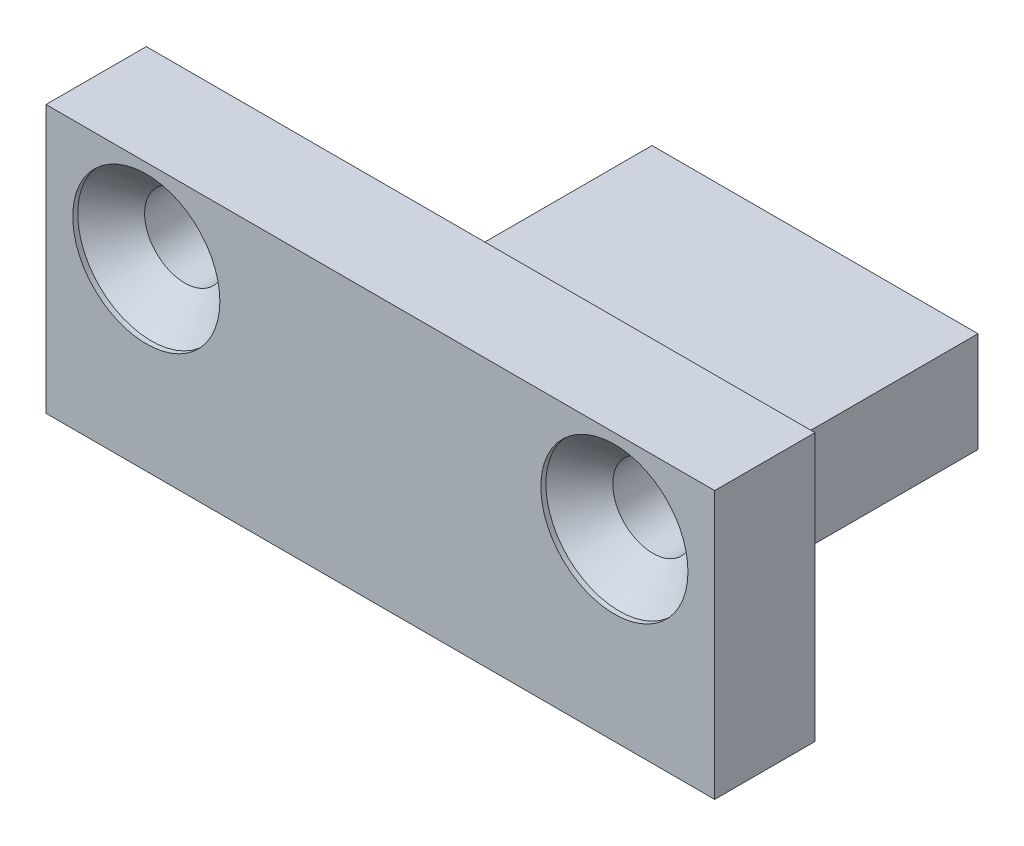
ISO-10303-21;
HEADER;
FILE_DESCRIPTION(('STEP AP214'),'2;1');
FILE_NAME('part.step','',(''),(''),'','','');
FILE_SCHEMA(('AUTOMOTIVE_DESIGN { 1 0 10303 214 1 1 1 1 }'));
ENDSEC;
DATA;
#1=APPLICATION_CONTEXT('core data for automotive mechanical design processes');
#2=APPLICATION_PROTOCOL_DEFINITION('international standard','automotive_design',2000,#1);
#3=PRODUCT_CONTEXT('',#1,'mechanical');
#4=PRODUCT('Part','Part','',(#3));
#5=PRODUCT_RELATED_PRODUCT_CATEGORY('part','',(#4));
#6=PRODUCT_DEFINITION_FORMATION('','',#4);
#7=PRODUCT_DEFINITION_CONTEXT('part definition',#1,'design');
#8=PRODUCT_DEFINITION('design','',#6,#7);
#9=PRODUCT_DEFINITION_SHAPE('','',#8);
#10=(LENGTH_UNIT() NAMED_UNIT(*) SI_UNIT(.MILLI.,.METRE.));
#11=(NAMED_UNIT(*) PLANE_ANGLE_UNIT() SI_UNIT($,.RADIAN.));
#12=(NAMED_UNIT(*) SI_UNIT($,.STERADIAN.) SOLID_ANGLE_UNIT());
#13=UNCERTAINTY_MEASURE_WITH_UNIT(LENGTH_MEASURE(1.E-05),#10,'distance_accuracy_value','');
#14=(GEOMETRIC_REPRESENTATION_CONTEXT(3) GLOBAL_UNCERTAINTY_ASSIGNED_CONTEXT((#13)) GLOBAL_UNIT_ASSIGNED_CONTEXT((#10,
#11,#12)) REPRESENTATION_CONTEXT('',''));
#15=CARTESIAN_POINT('',(0.,0.,0.));
#16=DIRECTION('',(0.,0.,1.));
#17=DIRECTION('',(1.,0.,0.));
#18=AXIS2_PLACEMENT_3D('',#15,#16,#17);
#19=CARTESIAN_POINT('',(10.,5.,0.));
#20=DIRECTION('',(0.,0.,1.));
#21=DIRECTION('',(0.,-1.,0.));
#22=AXIS2_PLACEMENT_3D('',#19,#20,#21);
#23=PLANE('',#22);
#24=CARTESIAN_POINT('',(7.,2.5,0.));
#25=DIRECTION('',(0.,0.,1.));
#26=DIRECTION('',(0.,-1.,0.));
#27=AXIS2_PLACEMENT_3D('',#24,#25,#26);
#28=CIRCLE('',#27,1.2);
#29=CARTESIAN_POINT('',(7.,1.3,0.));
#30=VERTEX_POINT('',#29);
#31=EDGE_CURVE('E36',#30,#30,#28,.T.);
#32=ORIENTED_EDGE('',*,*,#31,.T.);
#33=EDGE_LOOP('',(#32));
#34=FACE_BOUND('',#33,.T.);
#35=CARTESIAN_POINT('',(-7.,2.5,0.));
#36=DIRECTION('',(0.,0.,1.));
#37=DIRECTION('',(0.,-1.,0.));
#38=AXIS2_PLACEMENT_3D('',#35,#36,#37);
#39=CIRCLE('',#38,1.2);
#40=CARTESIAN_POINT('',(-7.,1.3,0.));
#41=VERTEX_POINT('',#40);
#42=EDGE_CURVE('E143',#41,#41,#39,.T.);
#43=ORIENTED_EDGE('',*,*,#42,.T.);
#44=EDGE_LOOP('',(#43));
#45=FACE_BOUND('',#44,.T.);
#46=DIRECTION('',(0.,1.,0.));
#47=VECTOR('',#46,1.);
#48=CARTESIAN_POINT('',(-10.,5.,0.));
#49=LINE('',#48,#47);
#50=CARTESIAN_POINT('',(-10.,-3.,0.));
#51=VERTEX_POINT('',#50);
#52=CARTESIAN_POINT('',(-10.,5.,0.));
#53=VERTEX_POINT('',#52);
#54=EDGE_CURVE('E49',#51,#53,#49,.T.);
#55=ORIENTED_EDGE('',*,*,#54,.T.);
#56=DIRECTION('',(-1.,0.,0.));
#57=VECTOR('',#56,1.);
#58=CARTESIAN_POINT('',(10.,5.,0.));
#59=LINE('',#58,#57);
#60=CARTESIAN_POINT('',(10.,5.,0.));
#61=VERTEX_POINT('',#60);
#62=EDGE_CURVE('E11',#61,#53,#59,.T.);
#63=ORIENTED_EDGE('',*,*,#62,.F.);
#64=DIRECTION('',(0.,1.,0.));
#65=VECTOR('',#64,1.);
#66=CARTESIAN_POINT('',(10.,5.,0.));
#67=LINE('',#66,#65);
#68=CARTESIAN_POINT('',(10.,-3.,0.));
#69=VERTEX_POINT('',#68);
#70=EDGE_CURVE('E172',#69,#61,#67,.T.);
#71=ORIENTED_EDGE('',*,*,#70,.F.);
#72=DIRECTION('',(1.,0.,0.));
#73=VECTOR('',#72,1.);
#74=CARTESIAN_POINT('',(10.,-3.,0.));
#75=LINE('',#74,#73);
#76=CARTESIAN_POINT('',(4.875,-3.,0.));
#77=VERTEX_POINT('',#76);
#78=EDGE_CURVE('E120',#77,#69,#75,.T.);
#79=ORIENTED_EDGE('',*,*,#78,.F.);
#80=DIRECTION('',(0.,1.,0.));
#81=VECTOR('',#80,1.);
#82=CARTESIAN_POINT('',(4.875,-3.,0.));
#83=LINE('',#82,#81);
#84=CARTESIAN_POINT('',(4.875,0.,0.));
#85=VERTEX_POINT('',#84);
#86=EDGE_CURVE('E115',#77,#85,#83,.T.);
#87=ORIENTED_EDGE('',*,*,#86,.T.);
#88=DIRECTION('',(-1.,0.,0.));
#89=VECTOR('',#88,1.);
#90=CARTESIAN_POINT('',(10.,0.,0.));
#91=LINE('',#90,#89);
#92=CARTESIAN_POINT('',(-4.875,0.,0.));
#93=VERTEX_POINT('',#92);
#94=EDGE_CURVE('E139',#85,#93,#91,.T.);
#95=ORIENTED_EDGE('',*,*,#94,.T.);
#96=DIRECTION('',(0.,1.,0.));
#97=VECTOR('',#96,1.);
#98=CARTESIAN_POINT('',(-4.875,-3.,0.));
#99=LINE('',#98,#97);
#100=CARTESIAN_POINT('',(-4.875,-3.,0.));
#101=VERTEX_POINT('',#100);
#102=EDGE_CURVE('E165',#101,#93,#99,.T.);
#103=ORIENTED_EDGE('',*,*,#102,.F.);
#104=DIRECTION('',(1.,0.,0.));
#105=VECTOR('',#104,1.);
#106=CARTESIAN_POINT('',(-10.,-3.,0.));
#107=LINE('',#106,#105);
#108=EDGE_CURVE('E162',#51,#101,#107,.T.);
#109=ORIENTED_EDGE('',*,*,#108,.F.);
#110=EDGE_LOOP('',(#55,#63,#71,#79,#87,#95,#103,#109));
#111=FACE_BOUND('',#110,.T.);
#112=ADVANCED_FACE('F33',(#34,#45,#111),#23,.F.);
#113=CARTESIAN_POINT('',(10.,5.,3.));
#114=DIRECTION('',(0.,-1.,0.));
#115=DIRECTION('',(0.,0.,-1.));
#116=AXIS2_PLACEMENT_3D('',#113,#114,#115);
#117=PLANE('',#116);
#118=DIRECTION('',(0.,0.,1.));
#119=VECTOR('',#118,1.);
#120=CARTESIAN_POINT('',(-10.,5.,3.));
#121=LINE('',#120,#119);
#122=CARTESIAN_POINT('',(-10.,5.,3.));
#123=VERTEX_POINT('',#122);
#124=EDGE_CURVE('E180',#53,#123,#121,.T.);
#125=ORIENTED_EDGE('',*,*,#124,.T.);
#126=DIRECTION('',(-1.,0.,0.));
#127=VECTOR('',#126,1.);
#128=CARTESIAN_POINT('',(10.,5.,3.));
#129=LINE('',#128,#127);
#130=CARTESIAN_POINT('',(10.,5.,3.));
#131=VERTEX_POINT('',#130);
#132=EDGE_CURVE('E41',#131,#123,#129,.T.);
#133=ORIENTED_EDGE('',*,*,#132,.F.);
#134=DIRECTION('',(0.,0.,1.));
#135=VECTOR('',#134,1.);
#136=CARTESIAN_POINT('',(10.,5.,3.));
#137=LINE('',#136,#135);
#138=EDGE_CURVE('E79',#61,#131,#137,.T.);
#139=ORIENTED_EDGE('',*,*,#138,.F.);
#140=ORIENTED_EDGE('',*,*,#62,.T.);
#141=EDGE_LOOP('',(#125,#133,#139,#140));
#142=FACE_BOUND('',#141,.T.);
#143=ADVANCED_FACE('F203',(#142),#117,.F.);
#144=CARTESIAN_POINT('',(10.,-3.,3.));
#145=DIRECTION('',(0.,0.,-1.));
#146=DIRECTION('',(0.,1.,0.));
#147=AXIS2_PLACEMENT_3D('',#144,#145,#146);
#148=PLANE('',#147);
#149=CARTESIAN_POINT('',(7.,2.5,3.));
#150=DIRECTION('',(0.,0.,1.));
#151=DIRECTION('',(1.,0.,0.));
#152=AXIS2_PLACEMENT_3D('',#149,#150,#151);
#153=CIRCLE('',#152,2.2);
#154=CARTESIAN_POINT('',(9.2,2.5,3.));
#155=VERTEX_POINT('',#154);
#156=EDGE_CURVE('E220',#155,#155,#153,.T.);
#157=ORIENTED_EDGE('',*,*,#156,.F.);
#158=EDGE_LOOP('',(#157));
#159=FACE_BOUND('',#158,.T.);
#160=CARTESIAN_POINT('',(-7.,2.5,3.));
#161=DIRECTION('',(0.,0.,1.));
#162=DIRECTION('',(1.,0.,0.));
#163=AXIS2_PLACEMENT_3D('',#160,#161,#162);
#164=CIRCLE('',#163,2.2);
#165=CARTESIAN_POINT('',(-4.8,2.5,3.));
#166=VERTEX_POINT('',#165);
#167=EDGE_CURVE('E155',#166,#166,#164,.T.);
#168=ORIENTED_EDGE('',*,*,#167,.F.);
#169=EDGE_LOOP('',(#168));
#170=FACE_BOUND('',#169,.T.);
#171=DIRECTION('',(0.,-1.,0.));
#172=VECTOR('',#171,1.);
#173=CARTESIAN_POINT('',(-10.,-3.,3.));
#174=LINE('',#173,#172);
#175=CARTESIAN_POINT('',(-10.,-3.,3.));
#176=VERTEX_POINT('',#175);
#177=EDGE_CURVE('E74',#123,#176,#174,.T.);
#178=ORIENTED_EDGE('',*,*,#177,.T.);
#179=DIRECTION('',(-1.,0.,0.));
#180=VECTOR('',#179,1.);
#181=CARTESIAN_POINT('',(10.,-3.,3.));
#182=LINE('',#181,#180);
#183=CARTESIAN_POINT('',(10.,-3.,3.));
#184=VERTEX_POINT('',#183);
#185=EDGE_CURVE('E136',#184,#176,#182,.T.);
#186=ORIENTED_EDGE('',*,*,#185,.F.);
#187=DIRECTION('',(0.,-1.,0.));
#188=VECTOR('',#187,1.);
#189=CARTESIAN_POINT('',(10.,-3.,3.));
#190=LINE('',#189,#188);
#191=EDGE_CURVE('E58',#131,#184,#190,.T.);
#192=ORIENTED_EDGE('',*,*,#191,.F.);
#193=ORIENTED_EDGE('',*,*,#132,.T.);
#194=EDGE_LOOP('',(#178,#186,#192,#193));
#195=FACE_BOUND('',#194,.T.);
#196=ADVANCED_FACE('F208',(#159,#170,#195),#148,.F.);
#197=CARTESIAN_POINT('',(10.,-3.,-10.));
#198=DIRECTION('',(0.,1.,0.));
#199=DIRECTION('',(0.,0.,1.));
#200=AXIS2_PLACEMENT_3D('',#197,#198,#199);
#201=PLANE('',#200);
#202=DIRECTION('',(0.,0.,1.));
#203=VECTOR('',#202,1.);
#204=CARTESIAN_POINT('',(4.875,-3.,-10.));
#205=LINE('',#204,#203);
#206=CARTESIAN_POINT('',(4.875,-3.,-10.));
#207=VERTEX_POINT('',#206);
#208=EDGE_CURVE('E109',#207,#77,#205,.T.);
#209=ORIENTED_EDGE('',*,*,#208,.T.);
#210=ORIENTED_EDGE('',*,*,#78,.T.);
#211=DIRECTION('',(0.,0.,-1.));
#212=VECTOR('',#211,1.);
#213=CARTESIAN_POINT('',(10.,-3.,-10.));
#214=LINE('',#213,#212);
#215=EDGE_CURVE('E177',#184,#69,#214,.T.);
#216=ORIENTED_EDGE('',*,*,#215,.F.);
#217=ORIENTED_EDGE('',*,*,#185,.T.);
#218=DIRECTION('',(0.,0.,-1.));
#219=VECTOR('',#218,1.);
#220=CARTESIAN_POINT('',(-10.,-3.,-10.));
#221=LINE('',#220,#219);
#222=EDGE_CURVE('E174',#176,#51,#221,.T.);
#223=ORIENTED_EDGE('',*,*,#222,.T.);
#224=ORIENTED_EDGE('',*,*,#108,.T.);
#225=DIRECTION('',(0.,0.,-1.));
#226=VECTOR('',#225,1.);
#227=CARTESIAN_POINT('',(-4.875,-3.,-10.));
#228=LINE('',#227,#226);
#229=CARTESIAN_POINT('',(-4.875,-3.,-10.));
#230=VERTEX_POINT('',#229);
#231=EDGE_CURVE('E135',#101,#230,#228,.T.);
#232=ORIENTED_EDGE('',*,*,#231,.T.);
#233=DIRECTION('',(-1.,0.,0.));
#234=VECTOR('',#233,1.);
#235=CARTESIAN_POINT('',(10.,-3.,-10.));
#236=LINE('',#235,#234);
#237=EDGE_CURVE('E127',#207,#230,#236,.T.);
#238=ORIENTED_EDGE('',*,*,#237,.F.);
#239=EDGE_LOOP('',(#209,#210,#216,#217,#223,#224,#232,#238));
#240=FACE_BOUND('',#239,.T.);
#241=ADVANCED_FACE('F132',(#240),#201,.F.);
#242=CARTESIAN_POINT('',(10.,0.,-10.));
#243=DIRECTION('',(0.,0.,1.));
#244=DIRECTION('',(1.,0.,0.));
#245=AXIS2_PLACEMENT_3D('',#242,#243,#244);
#246=PLANE('',#245);
#247=DIRECTION('',(-1.,0.,0.));
#248=VECTOR('',#247,1.);
#249=CARTESIAN_POINT('',(10.,0.,-10.));
#250=LINE('',#249,#248);
#251=CARTESIAN_POINT('',(4.875,0.,-10.));
#252=VERTEX_POINT('',#251);
#253=CARTESIAN_POINT('',(-4.875,0.,-10.));
#254=VERTEX_POINT('',#253);
#255=EDGE_CURVE('E129',#252,#254,#250,.T.);
#256=ORIENTED_EDGE('',*,*,#255,.F.);
#257=DIRECTION('',(0.,1.,0.));
#258=VECTOR('',#257,1.);
#259=CARTESIAN_POINT('',(4.875,-3.,-10.));
#260=LINE('',#259,#258);
#261=EDGE_CURVE('E113',#207,#252,#260,.T.);
#262=ORIENTED_EDGE('',*,*,#261,.F.);
#263=ORIENTED_EDGE('',*,*,#237,.T.);
#264=DIRECTION('',(0.,1.,0.));
#265=VECTOR('',#264,1.);
#266=CARTESIAN_POINT('',(-4.875,-3.,-10.));
#267=LINE('',#266,#265);
#268=EDGE_CURVE('E168',#230,#254,#267,.T.);
#269=ORIENTED_EDGE('',*,*,#268,.T.);
#270=EDGE_LOOP('',(#256,#262,#263,#269));
#271=FACE_BOUND('',#270,.T.);
#272=ADVANCED_FACE('F125',(#271),#246,.F.);
#273=CARTESIAN_POINT('',(10.,0.,0.));
#274=DIRECTION('',(0.,-1.,0.));
#275=DIRECTION('',(0.,0.,-1.));
#276=AXIS2_PLACEMENT_3D('',#273,#274,#275);
#277=PLANE('',#276);
#278=ORIENTED_EDGE('',*,*,#94,.F.);
#279=DIRECTION('',(0.,0.,1.));
#280=VECTOR('',#279,1.);
#281=CARTESIAN_POINT('',(4.875,0.,-10.));
#282=LINE('',#281,#280);
#283=EDGE_CURVE('E121',#252,#85,#282,.T.);
#284=ORIENTED_EDGE('',*,*,#283,.F.);
#285=ORIENTED_EDGE('',*,*,#255,.T.);
#286=DIRECTION('',(0.,0.,-1.));
#287=VECTOR('',#286,1.);
#288=CARTESIAN_POINT('',(-4.875,0.,-10.));
#289=LINE('',#288,#287);
#290=EDGE_CURVE('E160',#93,#254,#289,.T.);
#291=ORIENTED_EDGE('',*,*,#290,.F.);
#292=EDGE_LOOP('',(#278,#284,#285,#291));
#293=FACE_BOUND('',#292,.T.);
#294=ADVANCED_FACE('F190',(#293),#277,.F.);
#295=CARTESIAN_POINT('',(10.,0.,0.));
#296=DIRECTION('',(1.,0.,0.));
#297=DIRECTION('',(0.,0.,-1.));
#298=AXIS2_PLACEMENT_3D('',#295,#296,#297);
#299=PLANE('',#298);
#300=ORIENTED_EDGE('',*,*,#215,.T.);
#301=ORIENTED_EDGE('',*,*,#70,.T.);
#302=ORIENTED_EDGE('',*,*,#138,.T.);
#303=ORIENTED_EDGE('',*,*,#191,.T.);
#304=EDGE_LOOP('',(#300,#301,#302,#303));
#305=FACE_BOUND('',#304,.T.);
#306=ADVANCED_FACE('F192',(#305),#299,.T.);
#307=CARTESIAN_POINT('',(-10.,0.,0.));
#308=DIRECTION('',(1.,0.,0.));
#309=DIRECTION('',(0.,0.,-1.));
#310=AXIS2_PLACEMENT_3D('',#307,#308,#309);
#311=PLANE('',#310);
#312=ORIENTED_EDGE('',*,*,#54,.F.);
#313=ORIENTED_EDGE('',*,*,#222,.F.);
#314=ORIENTED_EDGE('',*,*,#177,.F.);
#315=ORIENTED_EDGE('',*,*,#124,.F.);
#316=EDGE_LOOP('',(#312,#313,#314,#315));
#317=FACE_BOUND('',#316,.T.);
#318=ADVANCED_FACE('F198',(#317),#311,.F.);
#319=CARTESIAN_POINT('',(-4.875,-3.,-10.));
#320=DIRECTION('',(1.,0.,0.));
#321=DIRECTION('',(0.,0.,-1.));
#322=AXIS2_PLACEMENT_3D('',#319,#320,#321);
#323=PLANE('',#322);
#324=ORIENTED_EDGE('',*,*,#290,.T.);
#325=ORIENTED_EDGE('',*,*,#268,.F.);
#326=ORIENTED_EDGE('',*,*,#231,.F.);
#327=ORIENTED_EDGE('',*,*,#102,.T.);
#328=EDGE_LOOP('',(#324,#325,#326,#327));
#329=FACE_BOUND('',#328,.T.);
#330=ADVANCED_FACE('F189',(#329),#323,.F.);
#331=CARTESIAN_POINT('',(4.875,-3.,-10.));
#332=DIRECTION('',(-1.,0.,0.));
#333=DIRECTION('',(0.,0.,1.));
#334=AXIS2_PLACEMENT_3D('',#331,#332,#333);
#335=PLANE('',#334);
#336=ORIENTED_EDGE('',*,*,#283,.T.);
#337=ORIENTED_EDGE('',*,*,#86,.F.);
#338=ORIENTED_EDGE('',*,*,#208,.F.);
#339=ORIENTED_EDGE('',*,*,#261,.T.);
#340=EDGE_LOOP('',(#336,#337,#338,#339));
#341=FACE_BOUND('',#340,.T.);
#342=ADVANCED_FACE('F112',(#341),#335,.F.);
#343=CARTESIAN_POINT('',(-7.,2.5,3.));
#344=DIRECTION('',(0.,0.,1.));
#345=DIRECTION('',(1.,0.,0.));
#346=AXIS2_PLACEMENT_3D('',#343,#344,#345);
#347=CYLINDRICAL_SURFACE('',#346,1.2);
#348=CARTESIAN_POINT('',(-7.,2.5,1.85));
#349=DIRECTION('',(0.,0.,1.));
#350=DIRECTION('',(1.,0.,0.));
#351=AXIS2_PLACEMENT_3D('',#348,#349,#350);
#352=CIRCLE('',#351,1.2);
#353=CARTESIAN_POINT('',(-5.8,2.5,1.85));
#354=VERTEX_POINT('',#353);
#355=EDGE_CURVE('E145',#354,#354,#352,.T.);
#356=ORIENTED_EDGE('',*,*,#355,.T.);
#357=EDGE_LOOP('',(#356));
#358=FACE_BOUND('',#357,.T.);
#359=ORIENTED_EDGE('',*,*,#42,.F.);
#360=EDGE_LOOP('',(#359));
#361=FACE_BOUND('',#360,.T.);
#362=ADVANCED_FACE('F245',(#358,#361),#347,.F.);
#363=CARTESIAN_POINT('',(-7.,2.5,2.85));
#364=DIRECTION('',(0.,0.,1.));
#365=DIRECTION('',(1.,0.,0.));
#366=AXIS2_PLACEMENT_3D('',#363,#364,#365);
#367=CONICAL_SURFACE('',#366,2.2,0.785398163397446);
#368=ORIENTED_EDGE('',*,*,#355,.F.);
#369=EDGE_LOOP('',(#368));
#370=FACE_BOUND('',#369,.T.);
#371=CARTESIAN_POINT('',(-7.,2.5,2.85));
#372=DIRECTION('',(0.,0.,1.));
#373=DIRECTION('',(1.,0.,0.));
#374=AXIS2_PLACEMENT_3D('',#371,#372,#373);
#375=CIRCLE('',#374,2.2);
#376=CARTESIAN_POINT('',(-4.8,2.5,2.85));
#377=VERTEX_POINT('',#376);
#378=EDGE_CURVE('E150',#377,#377,#375,.T.);
#379=ORIENTED_EDGE('',*,*,#378,.T.);
#380=EDGE_LOOP('',(#379));
#381=FACE_BOUND('',#380,.T.);
#382=ADVANCED_FACE('F236',(#370,#381),#367,.F.);
#383=CARTESIAN_POINT('',(-7.,2.5,3.));
#384=DIRECTION('',(0.,0.,1.));
#385=DIRECTION('',(1.,0.,0.));
#386=AXIS2_PLACEMENT_3D('',#383,#384,#385);
#387=CYLINDRICAL_SURFACE('',#386,2.2);
#388=ORIENTED_EDGE('',*,*,#378,.F.);
#389=EDGE_LOOP('',(#388));
#390=FACE_BOUND('',#389,.T.);
#391=ORIENTED_EDGE('',*,*,#167,.T.);
#392=EDGE_LOOP('',(#391));
#393=FACE_BOUND('',#392,.T.);
#394=ADVANCED_FACE('F233',(#390,#393),#387,.F.);
#395=CARTESIAN_POINT('',(7.,2.5,3.));
#396=DIRECTION('',(0.,0.,1.));
#397=DIRECTION('',(1.,0.,0.));
#398=AXIS2_PLACEMENT_3D('',#395,#396,#397);
#399=CYLINDRICAL_SURFACE('',#398,1.2);
#400=CARTESIAN_POINT('',(7.,2.5,1.85));
#401=DIRECTION('',(0.,0.,1.));
#402=DIRECTION('',(1.,0.,0.));
#403=AXIS2_PLACEMENT_3D('',#400,#401,#402);
#404=CIRCLE('',#403,1.2);
#405=CARTESIAN_POINT('',(8.2,2.5,1.85));
#406=VERTEX_POINT('',#405);
#407=EDGE_CURVE('E212',#406,#406,#404,.T.);
#408=ORIENTED_EDGE('',*,*,#407,.T.);
#409=EDGE_LOOP('',(#408));
#410=FACE_BOUND('',#409,.T.);
#411=ORIENTED_EDGE('',*,*,#31,.F.);
#412=EDGE_LOOP('',(#411));
#413=FACE_BOUND('',#412,.T.);
#414=ADVANCED_FACE('F235',(#410,#413),#399,.F.);
#415=CARTESIAN_POINT('',(7.,2.5,2.85));
#416=DIRECTION('',(0.,0.,1.));
#417=DIRECTION('',(1.,0.,0.));
#418=AXIS2_PLACEMENT_3D('',#415,#416,#417);
#419=CONICAL_SURFACE('',#418,2.2,0.785398163397446);
#420=ORIENTED_EDGE('',*,*,#407,.F.);
#421=EDGE_LOOP('',(#420));
#422=FACE_BOUND('',#421,.T.);
#423=CARTESIAN_POINT('',(7.,2.5,2.85));
#424=DIRECTION('',(0.,0.,1.));
#425=DIRECTION('',(1.,0.,0.));
#426=AXIS2_PLACEMENT_3D('',#423,#424,#425);
#427=CIRCLE('',#426,2.2);
#428=CARTESIAN_POINT('',(9.2,2.5,2.85));
#429=VERTEX_POINT('',#428);
#430=EDGE_CURVE('E215',#429,#429,#427,.T.);
#431=ORIENTED_EDGE('',*,*,#430,.T.);
#432=EDGE_LOOP('',(#431));
#433=FACE_BOUND('',#432,.T.);
#434=ADVANCED_FACE('F243',(#422,#433),#419,.F.);
#435=CARTESIAN_POINT('',(7.,2.5,3.));
#436=DIRECTION('',(0.,0.,1.));
#437=DIRECTION('',(1.,0.,0.));
#438=AXIS2_PLACEMENT_3D('',#435,#436,#437);
#439=CYLINDRICAL_SURFACE('',#438,2.2);
#440=ORIENTED_EDGE('',*,*,#430,.F.);
#441=EDGE_LOOP('',(#440));
#442=FACE_BOUND('',#441,.T.);
#443=ORIENTED_EDGE('',*,*,#156,.T.);
#444=EDGE_LOOP('',(#443));
#445=FACE_BOUND('',#444,.T.);
#446=ADVANCED_FACE('F226',(#442,#445),#439,.F.);
#447=CLOSED_SHELL('',(#112,#143,#196,#241,#272,#294,#306,#318,#330,#342,#362,#382,#394,#414,
#434,#446));
#448=MANIFOLD_SOLID_BREP('B2',#447);
#449=ADVANCED_BREP_SHAPE_REPRESENTATION('',(#18,#448),#14);
#450=SHAPE_DEFINITION_REPRESENTATION(#9,#449);
ENDSEC;
END-ISO-10303-21;
